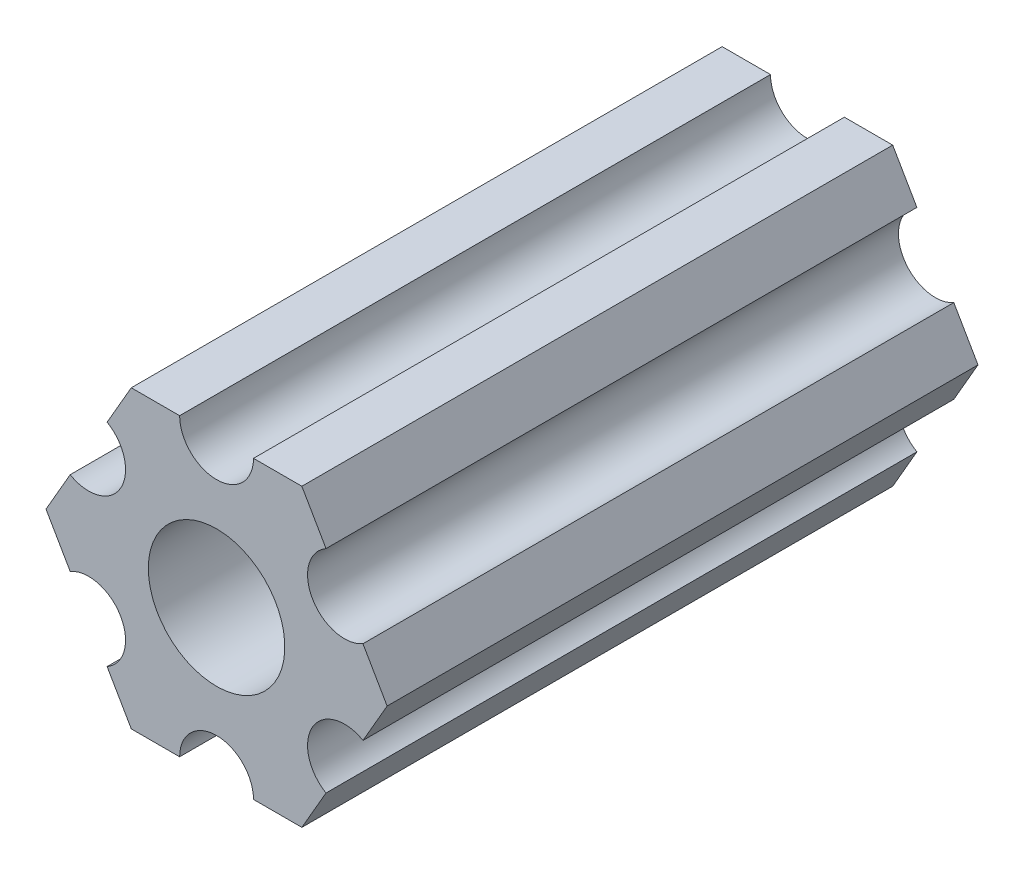
ISO-10303-21;
HEADER;
FILE_DESCRIPTION(('STEP AP214'),'2;1');
FILE_NAME('part.step','',(''),(''),'','','');
FILE_SCHEMA(('AUTOMOTIVE_DESIGN { 1 0 10303 214 1 1 1 1 }'));
ENDSEC;
DATA;
#1=APPLICATION_CONTEXT('core data for automotive mechanical design processes');
#2=APPLICATION_PROTOCOL_DEFINITION('international standard','automotive_design',2000,#1);
#3=PRODUCT_CONTEXT('',#1,'mechanical');
#4=PRODUCT('Part','Part','',(#3));
#5=PRODUCT_RELATED_PRODUCT_CATEGORY('part','',(#4));
#6=PRODUCT_DEFINITION_FORMATION('','',#4);
#7=PRODUCT_DEFINITION_CONTEXT('part definition',#1,'design');
#8=PRODUCT_DEFINITION('design','',#6,#7);
#9=PRODUCT_DEFINITION_SHAPE('','',#8);
#10=(LENGTH_UNIT() NAMED_UNIT(*) SI_UNIT(.MILLI.,.METRE.));
#11=(NAMED_UNIT(*) PLANE_ANGLE_UNIT() SI_UNIT($,.RADIAN.));
#12=(NAMED_UNIT(*) SI_UNIT($,.STERADIAN.) SOLID_ANGLE_UNIT());
#13=UNCERTAINTY_MEASURE_WITH_UNIT(LENGTH_MEASURE(1.E-05),#10,'distance_accuracy_value','');
#14=(GEOMETRIC_REPRESENTATION_CONTEXT(3) GLOBAL_UNCERTAINTY_ASSIGNED_CONTEXT((#13)) GLOBAL_UNIT_ASSIGNED_CONTEXT((#10,
#11,#12)) REPRESENTATION_CONTEXT('',''));
#15=CARTESIAN_POINT('',(0.,0.,0.));
#16=DIRECTION('',(0.,0.,1.));
#17=DIRECTION('',(1.,0.,0.));
#18=AXIS2_PLACEMENT_3D('',#15,#16,#17);
#19=CARTESIAN_POINT('',(6.29301142309098,-1.80018429024546,304.8));
#20=DIRECTION('',(-0.866025434075723,0.499999947533953,0.));
#21=DIRECTION('',(-0.499999947533953,-0.866025434075723,0.));
#22=AXIS2_PLACEMENT_3D('',#19,#20,#21);
#23=PLANE('',#22);
#24=DIRECTION('',(0.499999947533953,0.866025434075723,0.));
#25=VECTOR('',#24,1.);
#26=CARTESIAN_POINT('',(6.29301142309098,-1.80018429024546,-130.524));
#27=LINE('',#26,#25);
#28=CARTESIAN_POINT('',(6.29301142309098,-1.80018429024546,-130.524));
#29=VERTEX_POINT('',#28);
#30=CARTESIAN_POINT('',(7.33234841870826,4.44212518896171E-07,-130.524));
#31=VERTEX_POINT('',#30);
#32=EDGE_CURVE('E140',#29,#31,#27,.T.);
#33=ORIENTED_EDGE('',*,*,#32,.T.);
#34=DIRECTION('',(0.,0.,1.));
#35=VECTOR('',#34,1.);
#36=CARTESIAN_POINT('',(7.33234841870826,4.44212519225153E-07,304.8));
#37=LINE('',#36,#35);
#38=CARTESIAN_POINT('',(7.33234841870826,4.44212519207655E-07,-105.124));
#39=VERTEX_POINT('',#38);
#40=EDGE_CURVE('E127',#31,#39,#37,.T.);
#41=ORIENTED_EDGE('',*,*,#40,.T.);
#42=DIRECTION('',(0.499999947533953,0.866025434075723,0.));
#43=VECTOR('',#42,1.);
#44=CARTESIAN_POINT('',(6.29301142309098,-1.80018429024546,-105.124));
#45=LINE('',#44,#43);
#46=CARTESIAN_POINT('',(6.29301142309098,-1.80018429024546,-105.124));
#47=VERTEX_POINT('',#46);
#48=EDGE_CURVE('E146',#47,#39,#45,.T.);
#49=ORIENTED_EDGE('',*,*,#48,.F.);
#50=DIRECTION('',(0.,0.,-1.));
#51=VECTOR('',#50,1.);
#52=CARTESIAN_POINT('',(6.29301142309098,-1.80018429024546,304.8));
#53=LINE('',#52,#51);
#54=EDGE_CURVE('E145',#47,#29,#53,.T.);
#55=ORIENTED_EDGE('',*,*,#54,.T.);
#56=EDGE_LOOP('',(#33,#41,#49,#55));
#57=FACE_BOUND('',#56,.T.);
#58=ADVANCED_FACE('F16',(#57),#23,.F.);
#59=CARTESIAN_POINT('',(7.33234841870826,4.44212519169686E-07,304.8));
#60=DIRECTION('',(-0.866025373493145,-0.500000052466056,0.));
#61=DIRECTION('',(0.500000052466056,-0.866025373493145,0.));
#62=AXIS2_PLACEMENT_3D('',#59,#60,#61);
#63=PLANE('',#62);
#64=DIRECTION('',(-0.500000052466056,0.866025373493145,0.));
#65=VECTOR('',#64,1.);
#66=CARTESIAN_POINT('',(7.33234841870826,4.44212519198905E-07,-130.524));
#67=LINE('',#66,#65);
#68=CARTESIAN_POINT('',(6.29301120497139,1.80018505273894,-130.524));
#69=VERTEX_POINT('',#68);
#70=EDGE_CURVE('E130',#31,#69,#67,.T.);
#71=ORIENTED_EDGE('',*,*,#70,.T.);
#72=DIRECTION('',(0.,0.,-1.));
#73=VECTOR('',#72,1.);
#74=CARTESIAN_POINT('',(6.29301120497139,1.80018505273894,304.8));
#75=LINE('',#74,#73);
#76=CARTESIAN_POINT('',(6.29301120497139,1.80018505273894,-105.124));
#77=VERTEX_POINT('',#76);
#78=EDGE_CURVE('E119',#69,#77,#75,.F.);
#79=ORIENTED_EDGE('',*,*,#78,.T.);
#80=DIRECTION('',(-0.500000052466056,0.866025373493145,0.));
#81=VECTOR('',#80,1.);
#82=CARTESIAN_POINT('',(7.33234841870826,4.44212519198905E-07,-105.124));
#83=LINE('',#82,#81);
#84=EDGE_CURVE('E131',#39,#77,#83,.T.);
#85=ORIENTED_EDGE('',*,*,#84,.F.);
#86=ORIENTED_EDGE('',*,*,#40,.F.);
#87=EDGE_LOOP('',(#71,#79,#85,#86));
#88=FACE_BOUND('',#87,.T.);
#89=ADVANCED_FACE('F129',(#88),#63,.F.);
#90=CARTESIAN_POINT('',(5.49926112168156,3.17500033315933,304.8));
#91=DIRECTION('',(0.,0.,-1.));
#92=DIRECTION('',(-1.,0.,0.));
#93=AXIS2_PLACEMENT_3D('',#90,#91,#92);
#94=CYLINDRICAL_SURFACE('',#93,1.5875);
#95=CARTESIAN_POINT('',(5.49926112168156,3.17500033315933,-130.524));
#96=DIRECTION('',(0.,0.,-1.));
#97=DIRECTION('',(-1.,0.,0.));
#98=AXIS2_PLACEMENT_3D('',#95,#96,#97);
#99=CIRCLE('',#98,1.5875);
#100=CARTESIAN_POINT('',(4.70551103839172,4.54981561357972,-130.524));
#101=VERTEX_POINT('',#100);
#102=EDGE_CURVE('E19',#69,#101,#99,.T.);
#103=ORIENTED_EDGE('',*,*,#102,.T.);
#104=DIRECTION('',(0.,0.,1.));
#105=VECTOR('',#104,1.);
#106=CARTESIAN_POINT('',(4.70551103839172,4.54981561357972,304.8));
#107=LINE('',#106,#105);
#108=CARTESIAN_POINT('',(4.70551103839172,4.54981561357972,-105.124));
#109=VERTEX_POINT('',#108);
#110=EDGE_CURVE('E262',#101,#109,#107,.T.);
#111=ORIENTED_EDGE('',*,*,#110,.T.);
#112=CARTESIAN_POINT('',(5.49926112168156,3.17500033315933,-105.124));
#113=DIRECTION('',(0.,0.,-1.));
#114=DIRECTION('',(-1.,0.,0.));
#115=AXIS2_PLACEMENT_3D('',#112,#113,#114);
#116=CIRCLE('',#115,1.5875);
#117=EDGE_CURVE('E290',#77,#109,#116,.T.);
#118=ORIENTED_EDGE('',*,*,#117,.F.);
#119=ORIENTED_EDGE('',*,*,#78,.F.);
#120=EDGE_LOOP('',(#103,#111,#118,#119));
#121=FACE_BOUND('',#120,.T.);
#122=ADVANCED_FACE('F560',(#121),#94,.F.);
#123=CARTESIAN_POINT('',(4.70551103839172,4.54981561357972,304.8));
#124=DIRECTION('',(-0.866025373493151,-0.500000052466046,0.));
#125=DIRECTION('',(0.500000052466046,-0.866025373493151,0.));
#126=AXIS2_PLACEMENT_3D('',#123,#124,#125);
#127=PLANE('',#126);
#128=DIRECTION('',(-0.500000052466044,0.866025373493152,0.));
#129=VECTOR('',#128,1.);
#130=CARTESIAN_POINT('',(4.70551103839172,4.54981561357972,-130.524));
#131=LINE('',#130,#129);
#132=CARTESIAN_POINT('',(3.66617382465481,6.35000022210627,-130.524));
#133=VERTEX_POINT('',#132);
#134=EDGE_CURVE('E204',#101,#133,#131,.T.);
#135=ORIENTED_EDGE('',*,*,#134,.T.);
#136=DIRECTION('',(0.,0.,1.));
#137=VECTOR('',#136,1.);
#138=CARTESIAN_POINT('',(3.66617382465481,6.35000022210627,304.8));
#139=LINE('',#138,#137);
#140=CARTESIAN_POINT('',(3.66617382465481,6.35000022210627,-105.124));
#141=VERTEX_POINT('',#140);
#142=EDGE_CURVE('E259',#133,#141,#139,.T.);
#143=ORIENTED_EDGE('',*,*,#142,.T.);
#144=DIRECTION('',(-0.500000052466044,0.866025373493152,0.));
#145=VECTOR('',#144,1.);
#146=CARTESIAN_POINT('',(4.70551103839172,4.54981561357972,-105.124));
#147=LINE('',#146,#145);
#148=EDGE_CURVE('E291',#109,#141,#147,.T.);
#149=ORIENTED_EDGE('',*,*,#148,.F.);
#150=ORIENTED_EDGE('',*,*,#110,.F.);
#151=EDGE_LOOP('',(#135,#143,#149,#150));
#152=FACE_BOUND('',#151,.T.);
#153=ADVANCED_FACE('F314',(#152),#127,.F.);
#154=CARTESIAN_POINT('',(3.66617382465481,6.35000022210627,304.8));
#155=DIRECTION('',(6.05825850611185E-08,-0.999999999999998,0.));
#156=DIRECTION('',(0.999999999999998,6.05825850611185E-08,0.));
#157=AXIS2_PLACEMENT_3D('',#154,#155,#156);
#158=PLANE('',#157);
#159=DIRECTION('',(1.,0.,0.));
#160=VECTOR('',#159,1.);
#161=CARTESIAN_POINT('',(5.49926112168156,6.35000022210627,-130.524));
#162=LINE('',#161,#160);
#163=CARTESIAN_POINT('',(1.58749961530073,6.35000015914054,-130.524));
#164=VERTEX_POINT('',#163);
#165=EDGE_CURVE('E201',#133,#164,#162,.F.);
#166=ORIENTED_EDGE('',*,*,#165,.T.);
#167=DIRECTION('',(0.,0.,-1.));
#168=VECTOR('',#167,1.);
#169=CARTESIAN_POINT('',(1.58749961530074,6.35000009617482,304.8));
#170=LINE('',#169,#168);
#171=CARTESIAN_POINT('',(1.58749961530073,6.35000015914054,-105.124));
#172=VERTEX_POINT('',#171);
#173=EDGE_CURVE('E256',#164,#172,#170,.F.);
#174=ORIENTED_EDGE('',*,*,#173,.T.);
#175=DIRECTION('',(1.,0.,0.));
#176=VECTOR('',#175,1.);
#177=CARTESIAN_POINT('',(5.49926112168156,6.35000022210627,-105.124));
#178=LINE('',#177,#176);
#179=EDGE_CURVE('E289',#141,#172,#178,.F.);
#180=ORIENTED_EDGE('',*,*,#179,.F.);
#181=ORIENTED_EDGE('',*,*,#142,.F.);
#182=EDGE_LOOP('',(#166,#174,#180,#181));
#183=FACE_BOUND('',#182,.T.);
#184=ADVANCED_FACE('F309',(#183),#158,.F.);
#185=CARTESIAN_POINT('',(-3.84699260060323E-07,6.35,304.8));
#186=DIRECTION('',(0.,0.,-1.));
#187=DIRECTION('',(-1.,0.,0.));
#188=AXIS2_PLACEMENT_3D('',#185,#186,#187);
#189=CYLINDRICAL_SURFACE('',#188,1.5875);
#190=CARTESIAN_POINT('',(-3.84699260060323E-07,6.35,-130.524));
#191=DIRECTION('',(0.,0.,-1.));
#192=DIRECTION('',(-1.,0.,0.));
#193=AXIS2_PLACEMENT_3D('',#190,#191,#192);
#194=CIRCLE('',#193,1.5875);
#195=CARTESIAN_POINT('',(-1.58750038469926,6.34999990382518,-130.524));
#196=VERTEX_POINT('',#195);
#197=EDGE_CURVE('E198',#164,#196,#194,.T.);
#198=ORIENTED_EDGE('',*,*,#197,.T.);
#199=DIRECTION('',(0.,0.,1.));
#200=VECTOR('',#199,1.);
#201=CARTESIAN_POINT('',(-1.58750038469926,6.34999990382518,304.8));
#202=LINE('',#201,#200);
#203=CARTESIAN_POINT('',(-1.58750038469926,6.34999990382519,-105.124));
#204=VERTEX_POINT('',#203);
#205=EDGE_CURVE('E251',#196,#204,#202,.T.);
#206=ORIENTED_EDGE('',*,*,#205,.T.);
#207=CARTESIAN_POINT('',(-3.84699260060323E-07,6.35,-105.124));
#208=DIRECTION('',(0.,0.,-1.));
#209=DIRECTION('',(-1.,0.,0.));
#210=AXIS2_PLACEMENT_3D('',#207,#208,#209);
#211=CIRCLE('',#210,1.5875);
#212=EDGE_CURVE('E286',#172,#204,#211,.T.);
#213=ORIENTED_EDGE('',*,*,#212,.F.);
#214=ORIENTED_EDGE('',*,*,#173,.F.);
#215=EDGE_LOOP('',(#198,#206,#213,#214));
#216=FACE_BOUND('',#215,.T.);
#217=ADVANCED_FACE('F301',(#216),#189,.F.);
#218=CARTESIAN_POINT('',(-1.58750038469926,6.34999990382518,304.8));
#219=DIRECTION('',(6.05825963273174E-08,-0.999999999999998,0.));
#220=DIRECTION('',(0.999999999999998,6.05825963273174E-08,0.));
#221=AXIS2_PLACEMENT_3D('',#218,#219,#220);
#222=PLANE('',#221);
#223=DIRECTION('',(1.,0.,0.));
#224=VECTOR('',#223,1.);
#225=CARTESIAN_POINT('',(5.49926112168156,6.34999990382519,-130.524));
#226=LINE('',#225,#224);
#227=CARTESIAN_POINT('',(-3.66617454558244,6.34999986184803,-130.524));
#228=VERTEX_POINT('',#227);
#229=EDGE_CURVE('E193',#196,#228,#226,.F.);
#230=ORIENTED_EDGE('',*,*,#229,.T.);
#231=DIRECTION('',(0.,0.,1.));
#232=VECTOR('',#231,1.);
#233=CARTESIAN_POINT('',(-3.66617459405349,6.3499997778937,304.8));
#234=LINE('',#233,#232);
#235=CARTESIAN_POINT('',(-3.66617454558244,6.34999986184803,-105.124));
#236=VERTEX_POINT('',#235);
#237=EDGE_CURVE('E248',#228,#236,#234,.T.);
#238=ORIENTED_EDGE('',*,*,#237,.T.);
#239=DIRECTION('',(1.,0.,0.));
#240=VECTOR('',#239,1.);
#241=CARTESIAN_POINT('',(5.49926112168156,6.34999990382519,-105.124));
#242=LINE('',#241,#240);
#243=EDGE_CURVE('E288',#204,#236,#242,.F.);
#244=ORIENTED_EDGE('',*,*,#243,.F.);
#245=ORIENTED_EDGE('',*,*,#205,.F.);
#246=EDGE_LOOP('',(#230,#238,#244,#245));
#247=FACE_BOUND('',#246,.T.);
#248=ADVANCED_FACE('F369',(#247),#222,.F.);
#249=CARTESIAN_POINT('',(-3.66617459405349,6.3499997778937,304.8));
#250=DIRECTION('',(0.866025434075729,-0.499999947533943,0.));
#251=DIRECTION('',(0.499999947533943,0.866025434075729,0.));
#252=AXIS2_PLACEMENT_3D('',#249,#250,#251);
#253=PLANE('',#252);
#254=DIRECTION('',(-0.499999947533941,-0.86602543407573,0.));
#255=VECTOR('',#254,1.);
#256=CARTESIAN_POINT('',(-3.66617459405349,6.3499997778937,-130.524));
#257=LINE('',#256,#255);
#258=CARTESIAN_POINT('',(-4.70551158967065,4.54981504343587,-130.524));
#259=VERTEX_POINT('',#258);
#260=EDGE_CURVE('E190',#228,#259,#257,.T.);
#261=ORIENTED_EDGE('',*,*,#260,.T.);
#262=DIRECTION('',(0.,0.,-1.));
#263=VECTOR('',#262,1.);
#264=CARTESIAN_POINT('',(-4.70551158967065,4.54981504343587,304.8));
#265=LINE('',#264,#263);
#266=CARTESIAN_POINT('',(-4.70551158967065,4.54981504343587,-105.124));
#267=VERTEX_POINT('',#266);
#268=EDGE_CURVE('E245',#259,#267,#265,.F.);
#269=ORIENTED_EDGE('',*,*,#268,.T.);
#270=DIRECTION('',(-0.499999947533941,-0.86602543407573,0.));
#271=VECTOR('',#270,1.);
#272=CARTESIAN_POINT('',(-3.66617459405349,6.3499997778937,-105.124));
#273=LINE('',#272,#271);
#274=EDGE_CURVE('E285',#236,#267,#273,.T.);
#275=ORIENTED_EDGE('',*,*,#274,.F.);
#276=ORIENTED_EDGE('',*,*,#237,.F.);
#277=EDGE_LOOP('',(#261,#269,#275,#276));
#278=FACE_BOUND('',#277,.T.);
#279=ADVANCED_FACE('F371',(#278),#253,.F.);
#280=CARTESIAN_POINT('',(-5.49926150638082,3.17499966684067,304.8));
#281=DIRECTION('',(0.,0.,-1.));
#282=DIRECTION('',(-1.,0.,0.));
#283=AXIS2_PLACEMENT_3D('',#280,#281,#282);
#284=CYLINDRICAL_SURFACE('',#283,1.5875);
#285=CARTESIAN_POINT('',(-5.49926150638082,3.17499966684067,-130.524));
#286=DIRECTION('',(0.,0.,-1.));
#287=DIRECTION('',(-1.,0.,0.));
#288=AXIS2_PLACEMENT_3D('',#285,#286,#287);
#289=CIRCLE('',#288,1.5875);
#290=CARTESIAN_POINT('',(-6.29301142309098,1.80018429024547,-130.524));
#291=VERTEX_POINT('',#290);
#292=EDGE_CURVE('E187',#259,#291,#289,.T.);
#293=ORIENTED_EDGE('',*,*,#292,.T.);
#294=DIRECTION('',(0.,0.,1.));
#295=VECTOR('',#294,1.);
#296=CARTESIAN_POINT('',(-6.29301142309098,1.80018429024547,304.8));
#297=LINE('',#296,#295);
#298=CARTESIAN_POINT('',(-6.29301142309098,1.80018429024547,-105.124));
#299=VERTEX_POINT('',#298);
#300=EDGE_CURVE('E240',#291,#299,#297,.T.);
#301=ORIENTED_EDGE('',*,*,#300,.T.);
#302=CARTESIAN_POINT('',(-5.49926150638082,3.17499966684067,-105.124));
#303=DIRECTION('',(0.,0.,-1.));
#304=DIRECTION('',(-1.,0.,0.));
#305=AXIS2_PLACEMENT_3D('',#302,#303,#304);
#306=CIRCLE('',#305,1.5875);
#307=EDGE_CURVE('E282',#267,#299,#306,.T.);
#308=ORIENTED_EDGE('',*,*,#307,.F.);
#309=ORIENTED_EDGE('',*,*,#268,.F.);
#310=EDGE_LOOP('',(#293,#301,#308,#309));
#311=FACE_BOUND('',#310,.T.);
#312=ADVANCED_FACE('F407',(#311),#284,.F.);
#313=CARTESIAN_POINT('',(-6.29301142309098,1.80018429024547,304.8));
#314=DIRECTION('',(0.866025434075724,-0.499999947533951,0.));
#315=DIRECTION('',(0.499999947533951,0.866025434075724,0.));
#316=AXIS2_PLACEMENT_3D('',#313,#314,#315);
#317=PLANE('',#316);
#318=DIRECTION('',(-0.49999994753395,-0.866025434075724,0.));
#319=VECTOR('',#318,1.);
#320=CARTESIAN_POINT('',(-6.29301142309098,1.80018429024547,-130.524));
#321=LINE('',#320,#319);
#322=CARTESIAN_POINT('',(-7.33234841870826,-4.44212523605446E-07,-130.524));
#323=VERTEX_POINT('',#322);
#324=EDGE_CURVE('E182',#291,#323,#321,.T.);
#325=ORIENTED_EDGE('',*,*,#324,.T.);
#326=DIRECTION('',(0.,0.,1.));
#327=VECTOR('',#326,1.);
#328=CARTESIAN_POINT('',(-7.33234841870826,-4.44212523744911E-07,304.8));
#329=LINE('',#328,#327);
#330=CARTESIAN_POINT('',(-7.33234841870826,-4.44212523605446E-07,-105.124));
#331=VERTEX_POINT('',#330);
#332=EDGE_CURVE('E237',#323,#331,#329,.T.);
#333=ORIENTED_EDGE('',*,*,#332,.T.);
#334=DIRECTION('',(-0.49999994753395,-0.866025434075724,0.));
#335=VECTOR('',#334,1.);
#336=CARTESIAN_POINT('',(-6.29301142309098,1.80018429024547,-105.124));
#337=LINE('',#336,#335);
#338=EDGE_CURVE('E284',#299,#331,#337,.T.);
#339=ORIENTED_EDGE('',*,*,#338,.F.);
#340=ORIENTED_EDGE('',*,*,#300,.F.);
#341=EDGE_LOOP('',(#325,#333,#339,#340));
#342=FACE_BOUND('',#341,.T.);
#343=ADVANCED_FACE('F360',(#342),#317,.F.);
#344=CARTESIAN_POINT('',(-7.33234841870826,-4.44212523790841E-07,304.8));
#345=DIRECTION('',(0.866025373493151,0.500000052466045,0.));
#346=DIRECTION('',(-0.500000052466045,0.866025373493151,0.));
#347=AXIS2_PLACEMENT_3D('',#344,#345,#346);
#348=PLANE('',#347);
#349=DIRECTION('',(0.500000052466043,-0.866025373493152,0.));
#350=VECTOR('',#349,1.);
#351=CARTESIAN_POINT('',(-7.33234841870826,-4.44212523535714E-07,-130.524));
#352=LINE('',#351,#350);
#353=CARTESIAN_POINT('',(-6.29301120497141,-1.80018505273897,-130.524));
#354=VERTEX_POINT('',#353);
#355=EDGE_CURVE('E179',#323,#354,#352,.T.);
#356=ORIENTED_EDGE('',*,*,#355,.T.);
#357=DIRECTION('',(0.,0.,-1.));
#358=VECTOR('',#357,1.);
#359=CARTESIAN_POINT('',(-6.29301120497141,-1.80018505273897,304.8));
#360=LINE('',#359,#358);
#361=CARTESIAN_POINT('',(-6.29301120497141,-1.80018505273897,-105.124));
#362=VERTEX_POINT('',#361);
#363=EDGE_CURVE('E234',#354,#362,#360,.F.);
#364=ORIENTED_EDGE('',*,*,#363,.T.);
#365=DIRECTION('',(0.500000052466043,-0.866025373493152,0.));
#366=VECTOR('',#365,1.);
#367=CARTESIAN_POINT('',(-7.33234841870826,-4.44212523535714E-07,-105.124));
#368=LINE('',#367,#366);
#369=EDGE_CURVE('E281',#331,#362,#368,.T.);
#370=ORIENTED_EDGE('',*,*,#369,.F.);
#371=ORIENTED_EDGE('',*,*,#332,.F.);
#372=EDGE_LOOP('',(#356,#364,#370,#371));
#373=FACE_BOUND('',#372,.T.);
#374=ADVANCED_FACE('F355',(#373),#348,.F.);
#375=CARTESIAN_POINT('',(-5.49926112168156,-3.17500033315934,304.8));
#376=DIRECTION('',(0.,0.,-1.));
#377=DIRECTION('',(-1.,0.,0.));
#378=AXIS2_PLACEMENT_3D('',#375,#376,#377);
#379=CYLINDRICAL_SURFACE('',#378,1.5875);
#380=CARTESIAN_POINT('',(-5.49926112168156,-3.17500033315934,-130.524));
#381=DIRECTION('',(0.,0.,-1.));
#382=DIRECTION('',(-1.,0.,0.));
#383=AXIS2_PLACEMENT_3D('',#380,#381,#382);
#384=CIRCLE('',#383,1.5875);
#385=CARTESIAN_POINT('',(-4.70551103839172,-4.54981561357972,-130.524));
#386=VERTEX_POINT('',#385);
#387=EDGE_CURVE('E176',#354,#386,#384,.T.);
#388=ORIENTED_EDGE('',*,*,#387,.T.);
#389=DIRECTION('',(0.,0.,1.));
#390=VECTOR('',#389,1.);
#391=CARTESIAN_POINT('',(-4.70551103839172,-4.54981561357972,304.8));
#392=LINE('',#391,#390);
#393=CARTESIAN_POINT('',(-4.70551103839172,-4.54981561357972,-105.124));
#394=VERTEX_POINT('',#393);
#395=EDGE_CURVE('E229',#386,#394,#392,.T.);
#396=ORIENTED_EDGE('',*,*,#395,.T.);
#397=CARTESIAN_POINT('',(-5.49926112168156,-3.17500033315934,-105.124));
#398=DIRECTION('',(0.,0.,-1.));
#399=DIRECTION('',(-1.,0.,0.));
#400=AXIS2_PLACEMENT_3D('',#397,#398,#399);
#401=CIRCLE('',#400,1.5875);
#402=EDGE_CURVE('E278',#362,#394,#401,.T.);
#403=ORIENTED_EDGE('',*,*,#402,.F.);
#404=ORIENTED_EDGE('',*,*,#363,.F.);
#405=EDGE_LOOP('',(#388,#396,#403,#404));
#406=FACE_BOUND('',#405,.T.);
#407=ADVANCED_FACE('F350',(#406),#379,.F.);
#408=CARTESIAN_POINT('',(-4.70551103839172,-4.54981561357972,304.8));
#409=DIRECTION('',(0.866025373493151,0.500000052466045,0.));
#410=DIRECTION('',(-0.500000052466045,0.866025373493151,0.));
#411=AXIS2_PLACEMENT_3D('',#408,#409,#410);
#412=PLANE('',#411);
#413=DIRECTION('',(0.500000052466043,-0.866025373493152,0.));
#414=VECTOR('',#413,1.);
#415=CARTESIAN_POINT('',(-4.70551103839172,-4.54981561357972,-130.524));
#416=LINE('',#415,#414);
#417=CARTESIAN_POINT('',(-3.66617382465481,-6.35000022210627,-130.524));
#418=VERTEX_POINT('',#417);
#419=EDGE_CURVE('E171',#386,#418,#416,.T.);
#420=ORIENTED_EDGE('',*,*,#419,.T.);
#421=DIRECTION('',(0.,0.,1.));
#422=VECTOR('',#421,1.);
#423=CARTESIAN_POINT('',(-3.66617382465481,-6.35000022210627,304.8));
#424=LINE('',#423,#422);
#425=CARTESIAN_POINT('',(-3.66617382465481,-6.35000022210627,-105.124));
#426=VERTEX_POINT('',#425);
#427=EDGE_CURVE('E226',#418,#426,#424,.T.);
#428=ORIENTED_EDGE('',*,*,#427,.T.);
#429=DIRECTION('',(0.500000052466043,-0.866025373493152,0.));
#430=VECTOR('',#429,1.);
#431=CARTESIAN_POINT('',(-4.70551103839172,-4.54981561357972,-105.124));
#432=LINE('',#431,#430);
#433=EDGE_CURVE('E280',#394,#426,#432,.T.);
#434=ORIENTED_EDGE('',*,*,#433,.F.);
#435=ORIENTED_EDGE('',*,*,#395,.F.);
#436=EDGE_LOOP('',(#420,#428,#434,#435));
#437=FACE_BOUND('',#436,.T.);
#438=ADVANCED_FACE('F345',(#437),#412,.F.);
#439=CARTESIAN_POINT('',(-3.66617382465481,-6.35000022210627,304.8));
#440=DIRECTION('',(-6.05825854783851E-08,0.999999999999998,0.));
#441=DIRECTION('',(-0.999999999999998,-6.05825854783851E-08,0.));
#442=AXIS2_PLACEMENT_3D('',#439,#440,#441);
#443=PLANE('',#442);
#444=DIRECTION('',(1.,0.,0.));
#445=VECTOR('',#444,1.);
#446=CARTESIAN_POINT('',(5.49926112168156,-6.35000022210627,-130.524));
#447=LINE('',#446,#445);
#448=CARTESIAN_POINT('',(-1.58749961530073,-6.35000011105313,-130.524));
#449=VERTEX_POINT('',#448);
#450=EDGE_CURVE('E168',#418,#449,#447,.T.);
#451=ORIENTED_EDGE('',*,*,#450,.T.);
#452=DIRECTION('',(0.,0.,-1.));
#453=VECTOR('',#452,1.);
#454=CARTESIAN_POINT('',(-1.58749961530074,-6.35,304.8));
#455=LINE('',#454,#453);
#456=CARTESIAN_POINT('',(-1.58749961530073,-6.35000011105313,-105.124));
#457=VERTEX_POINT('',#456);
#458=EDGE_CURVE('E223',#449,#457,#455,.F.);
#459=ORIENTED_EDGE('',*,*,#458,.T.);
#460=DIRECTION('',(1.,0.,0.));
#461=VECTOR('',#460,1.);
#462=CARTESIAN_POINT('',(5.49926112168156,-6.35000022210627,-105.124));
#463=LINE('',#462,#461);
#464=EDGE_CURVE('E277',#426,#457,#463,.T.);
#465=ORIENTED_EDGE('',*,*,#464,.F.);
#466=ORIENTED_EDGE('',*,*,#427,.F.);
#467=EDGE_LOOP('',(#451,#459,#465,#466));
#468=FACE_BOUND('',#467,.T.);
#469=ADVANCED_FACE('F339',(#468),#443,.F.);
#470=CARTESIAN_POINT('',(3.8469926204343E-07,-6.35,304.8));
#471=DIRECTION('',(0.,0.,-1.));
#472=DIRECTION('',(-1.,0.,0.));
#473=AXIS2_PLACEMENT_3D('',#470,#471,#472);
#474=CYLINDRICAL_SURFACE('',#473,1.5875);
#475=CARTESIAN_POINT('',(3.8469926204343E-07,-6.35,-130.524));
#476=DIRECTION('',(0.,0.,-1.));
#477=DIRECTION('',(-1.,0.,0.));
#478=AXIS2_PLACEMENT_3D('',#475,#476,#477);
#479=CIRCLE('',#478,1.5875);
#480=CARTESIAN_POINT('',(1.58750038469926,-6.34999990382518,-130.524));
#481=VERTEX_POINT('',#480);
#482=EDGE_CURVE('E165',#449,#481,#479,.T.);
#483=ORIENTED_EDGE('',*,*,#482,.T.);
#484=DIRECTION('',(0.,0.,1.));
#485=VECTOR('',#484,1.);
#486=CARTESIAN_POINT('',(1.58750038469926,-6.34999990382518,304.8));
#487=LINE('',#486,#485);
#488=CARTESIAN_POINT('',(1.58750038469926,-6.34999990382518,-105.124));
#489=VERTEX_POINT('',#488);
#490=EDGE_CURVE('E218',#481,#489,#487,.T.);
#491=ORIENTED_EDGE('',*,*,#490,.T.);
#492=CARTESIAN_POINT('',(3.8469926204343E-07,-6.35,-105.124));
#493=DIRECTION('',(0.,0.,-1.));
#494=DIRECTION('',(-1.,0.,0.));
#495=AXIS2_PLACEMENT_3D('',#492,#493,#494);
#496=CIRCLE('',#495,1.5875);
#497=EDGE_CURVE('E274',#457,#489,#496,.T.);
#498=ORIENTED_EDGE('',*,*,#497,.F.);
#499=ORIENTED_EDGE('',*,*,#458,.F.);
#500=EDGE_LOOP('',(#483,#491,#498,#499));
#501=FACE_BOUND('',#500,.T.);
#502=ADVANCED_FACE('F335',(#501),#474,.F.);
#503=CARTESIAN_POINT('',(1.58750038469926,-6.34999990382518,304.8));
#504=DIRECTION('',(-6.05825721258438E-08,0.999999999999998,0.));
#505=DIRECTION('',(-0.999999999999998,-6.05825721258438E-08,0.));
#506=AXIS2_PLACEMENT_3D('',#503,#504,#505);
#507=PLANE('',#506);
#508=DIRECTION('',(1.,0.,0.));
#509=VECTOR('',#508,1.);
#510=CARTESIAN_POINT('',(5.49926112168156,-6.34999990382518,-130.524));
#511=LINE('',#510,#509);
#512=CARTESIAN_POINT('',(3.66617454558244,-6.34999986184804,-130.524));
#513=VERTEX_POINT('',#512);
#514=EDGE_CURVE('E160',#481,#513,#511,.T.);
#515=ORIENTED_EDGE('',*,*,#514,.T.);
#516=DIRECTION('',(0.,0.,1.));
#517=VECTOR('',#516,1.);
#518=CARTESIAN_POINT('',(3.66617459405346,-6.34999977789375,304.8));
#519=LINE('',#518,#517);
#520=CARTESIAN_POINT('',(3.66617454558244,-6.34999986184804,-105.124));
#521=VERTEX_POINT('',#520);
#522=EDGE_CURVE('E215',#513,#521,#519,.T.);
#523=ORIENTED_EDGE('',*,*,#522,.T.);
#524=DIRECTION('',(1.,0.,0.));
#525=VECTOR('',#524,1.);
#526=CARTESIAN_POINT('',(5.49926112168156,-6.34999990382518,-105.124));
#527=LINE('',#526,#525);
#528=EDGE_CURVE('E276',#489,#521,#527,.T.);
#529=ORIENTED_EDGE('',*,*,#528,.F.);
#530=ORIENTED_EDGE('',*,*,#490,.F.);
#531=EDGE_LOOP('',(#515,#523,#529,#530));
#532=FACE_BOUND('',#531,.T.);
#533=ADVANCED_FACE('F331',(#532),#507,.F.);
#534=CARTESIAN_POINT('',(3.66617459405346,-6.34999977789375,304.8));
#535=DIRECTION('',(-0.86602543407573,0.499999947533941,0.));
#536=DIRECTION('',(-0.499999947533941,-0.86602543407573,0.));
#537=AXIS2_PLACEMENT_3D('',#534,#535,#536);
#538=PLANE('',#537);
#539=DIRECTION('',(0.499999947533941,0.86602543407573,0.));
#540=VECTOR('',#539,1.);
#541=CARTESIAN_POINT('',(3.66617459405346,-6.34999977789375,-130.524));
#542=LINE('',#541,#540);
#543=CARTESIAN_POINT('',(4.70551158967065,-4.54981504343588,-130.524));
#544=VERTEX_POINT('',#543);
#545=EDGE_CURVE('E151',#513,#544,#542,.T.);
#546=ORIENTED_EDGE('',*,*,#545,.T.);
#547=DIRECTION('',(0.,0.,-1.));
#548=VECTOR('',#547,1.);
#549=CARTESIAN_POINT('',(4.70551158967065,-4.54981504343588,304.8));
#550=LINE('',#549,#548);
#551=CARTESIAN_POINT('',(4.70551158967065,-4.54981504343588,-105.124));
#552=VERTEX_POINT('',#551);
#553=EDGE_CURVE('E143',#544,#552,#550,.F.);
#554=ORIENTED_EDGE('',*,*,#553,.T.);
#555=DIRECTION('',(0.499999947533941,0.86602543407573,0.));
#556=VECTOR('',#555,1.);
#557=CARTESIAN_POINT('',(3.66617459405346,-6.34999977789375,-105.124));
#558=LINE('',#557,#556);
#559=EDGE_CURVE('E34',#521,#552,#558,.T.);
#560=ORIENTED_EDGE('',*,*,#559,.F.);
#561=ORIENTED_EDGE('',*,*,#522,.F.);
#562=EDGE_LOOP('',(#546,#554,#560,#561));
#563=FACE_BOUND('',#562,.T.);
#564=ADVANCED_FACE('F327',(#563),#538,.F.);
#565=CARTESIAN_POINT('',(5.49926150638082,-3.17499966684067,304.8));
#566=DIRECTION('',(0.,0.,-1.));
#567=DIRECTION('',(-1.,0.,0.));
#568=AXIS2_PLACEMENT_3D('',#565,#566,#567);
#569=CYLINDRICAL_SURFACE('',#568,1.58750000000001);
#570=CARTESIAN_POINT('',(5.49926150638082,-3.17499966684067,-130.524));
#571=DIRECTION('',(0.,0.,-1.));
#572=DIRECTION('',(-1.,0.,0.));
#573=AXIS2_PLACEMENT_3D('',#570,#571,#572);
#574=CIRCLE('',#573,1.58750000000001);
#575=EDGE_CURVE('E147',#544,#29,#574,.T.);
#576=ORIENTED_EDGE('',*,*,#575,.T.);
#577=ORIENTED_EDGE('',*,*,#54,.F.);
#578=CARTESIAN_POINT('',(5.49926150638082,-3.17499966684067,-105.124));
#579=DIRECTION('',(0.,0.,-1.));
#580=DIRECTION('',(-1.,0.,0.));
#581=AXIS2_PLACEMENT_3D('',#578,#579,#580);
#582=CIRCLE('',#581,1.58750000000001);
#583=EDGE_CURVE('E272',#552,#47,#582,.T.);
#584=ORIENTED_EDGE('',*,*,#583,.F.);
#585=ORIENTED_EDGE('',*,*,#553,.F.);
#586=EDGE_LOOP('',(#576,#577,#584,#585));
#587=FACE_BOUND('',#586,.T.);
#588=ADVANCED_FACE('F322',(#587),#569,.F.);
#589=CARTESIAN_POINT('',(5.49926112168156,3.17500033315933,-130.524));
#590=DIRECTION('',(0.,0.,1.));
#591=DIRECTION('',(1.,0.,0.));
#592=AXIS2_PLACEMENT_3D('',#589,#590,#591);
#593=PLANE('',#592);
#594=CARTESIAN_POINT('',(0.,0.,-130.524));
#595=DIRECTION('',(0.,0.,-1.));
#596=DIRECTION('',(-1.,0.,0.));
#597=AXIS2_PLACEMENT_3D('',#594,#595,#596);
#598=CIRCLE('',#597,2.9337);
#599=CARTESIAN_POINT('',(-2.9337,0.,-130.524));
#600=VERTEX_POINT('',#599);
#601=EDGE_CURVE('E25',#600,#600,#598,.F.);
#602=ORIENTED_EDGE('',*,*,#601,.T.);
#603=EDGE_LOOP('',(#602));
#604=FACE_BOUND('',#603,.T.);
#605=ORIENTED_EDGE('',*,*,#575,.F.);
#606=ORIENTED_EDGE('',*,*,#545,.F.);
#607=ORIENTED_EDGE('',*,*,#514,.F.);
#608=ORIENTED_EDGE('',*,*,#482,.F.);
#609=ORIENTED_EDGE('',*,*,#450,.F.);
#610=ORIENTED_EDGE('',*,*,#419,.F.);
#611=ORIENTED_EDGE('',*,*,#387,.F.);
#612=ORIENTED_EDGE('',*,*,#355,.F.);
#613=ORIENTED_EDGE('',*,*,#324,.F.);
#614=ORIENTED_EDGE('',*,*,#292,.F.);
#615=ORIENTED_EDGE('',*,*,#260,.F.);
#616=ORIENTED_EDGE('',*,*,#229,.F.);
#617=ORIENTED_EDGE('',*,*,#197,.F.);
#618=ORIENTED_EDGE('',*,*,#165,.F.);
#619=ORIENTED_EDGE('',*,*,#134,.F.);
#620=ORIENTED_EDGE('',*,*,#102,.F.);
#621=ORIENTED_EDGE('',*,*,#70,.F.);
#622=ORIENTED_EDGE('',*,*,#32,.F.);
#623=EDGE_LOOP('',(#605,#606,#607,#608,#609,#610,#611,#612,#613,#614,#615,#616,#617,#618,#619,
#620,#621,#622));
#624=FACE_BOUND('',#623,.T.);
#625=ADVANCED_FACE('F139',(#604,#624),#593,.F.);
#626=CARTESIAN_POINT('',(5.49926112168156,3.17500033315933,-105.124));
#627=DIRECTION('',(0.,0.,1.));
#628=DIRECTION('',(1.,0.,0.));
#629=AXIS2_PLACEMENT_3D('',#626,#627,#628);
#630=PLANE('',#629);
#631=CARTESIAN_POINT('',(0.,0.,-105.124));
#632=DIRECTION('',(0.,0.,-1.));
#633=DIRECTION('',(-1.,0.,0.));
#634=AXIS2_PLACEMENT_3D('',#631,#632,#633);
#635=CIRCLE('',#634,2.9337);
#636=CARTESIAN_POINT('',(-2.9337,0.,-105.124));
#637=VERTEX_POINT('',#636);
#638=EDGE_CURVE('E11',#637,#637,#635,.T.);
#639=ORIENTED_EDGE('',*,*,#638,.T.);
#640=EDGE_LOOP('',(#639));
#641=FACE_BOUND('',#640,.T.);
#642=ORIENTED_EDGE('',*,*,#559,.T.);
#643=ORIENTED_EDGE('',*,*,#583,.T.);
#644=ORIENTED_EDGE('',*,*,#48,.T.);
#645=ORIENTED_EDGE('',*,*,#84,.T.);
#646=ORIENTED_EDGE('',*,*,#117,.T.);
#647=ORIENTED_EDGE('',*,*,#148,.T.);
#648=ORIENTED_EDGE('',*,*,#179,.T.);
#649=ORIENTED_EDGE('',*,*,#212,.T.);
#650=ORIENTED_EDGE('',*,*,#243,.T.);
#651=ORIENTED_EDGE('',*,*,#274,.T.);
#652=ORIENTED_EDGE('',*,*,#307,.T.);
#653=ORIENTED_EDGE('',*,*,#338,.T.);
#654=ORIENTED_EDGE('',*,*,#369,.T.);
#655=ORIENTED_EDGE('',*,*,#402,.T.);
#656=ORIENTED_EDGE('',*,*,#433,.T.);
#657=ORIENTED_EDGE('',*,*,#464,.T.);
#658=ORIENTED_EDGE('',*,*,#497,.T.);
#659=ORIENTED_EDGE('',*,*,#528,.T.);
#660=EDGE_LOOP('',(#642,#643,#644,#645,#646,#647,#648,#649,#650,#651,#652,#653,#654,#655,#656,
#657,#658,#659));
#661=FACE_BOUND('',#660,.T.);
#662=ADVANCED_FACE('F319',(#641,#661),#630,.T.);
#663=CARTESIAN_POINT('',(0.,0.,304.8));
#664=DIRECTION('',(0.,0.,-1.));
#665=DIRECTION('',(-1.,0.,0.));
#666=AXIS2_PLACEMENT_3D('',#663,#664,#665);
#667=CYLINDRICAL_SURFACE('',#666,2.9337);
#668=ORIENTED_EDGE('',*,*,#601,.F.);
#669=EDGE_LOOP('',(#668));
#670=FACE_BOUND('',#669,.T.);
#671=ORIENTED_EDGE('',*,*,#638,.F.);
#672=EDGE_LOOP('',(#671));
#673=FACE_BOUND('',#672,.T.);
#674=ADVANCED_FACE('F417',(#670,#673),#667,.F.);
#675=CLOSED_SHELL('',(#58,#89,#122,#153,#184,#217,#248,#279,#312,#343,#374,#407,#438,#469,#502,
#533,#564,#588,#625,#662,#674));
#676=MANIFOLD_SOLID_BREP('B1',#675);
#677=ADVANCED_BREP_SHAPE_REPRESENTATION('',(#18,#676),#14);
#678=SHAPE_DEFINITION_REPRESENTATION(#9,#677);
ENDSEC;
END-ISO-10303-21;
